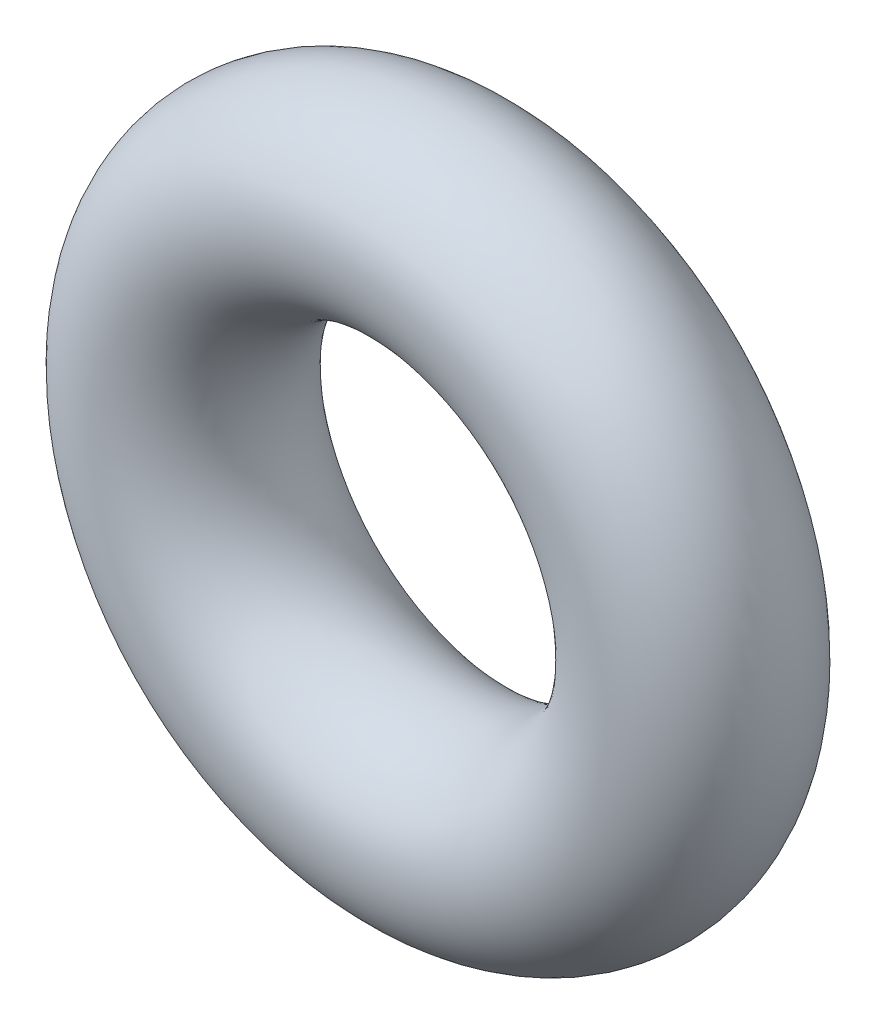
ISO-10303-21;
HEADER;
FILE_DESCRIPTION(('STEP AP214'),'2;1');
FILE_NAME('part.step','',(''),(''),'','','');
FILE_SCHEMA(('AUTOMOTIVE_DESIGN { 1 0 10303 214 1 1 1 1 }'));
ENDSEC;
DATA;
#1=APPLICATION_CONTEXT('core data for automotive mechanical design processes');
#2=APPLICATION_PROTOCOL_DEFINITION('international standard','automotive_design',2000,#1);
#3=PRODUCT_CONTEXT('',#1,'mechanical');
#4=PRODUCT('Part','Part','',(#3));
#5=PRODUCT_RELATED_PRODUCT_CATEGORY('part','',(#4));
#6=PRODUCT_DEFINITION_FORMATION('','',#4);
#7=PRODUCT_DEFINITION_CONTEXT('part definition',#1,'design');
#8=PRODUCT_DEFINITION('design','',#6,#7);
#9=PRODUCT_DEFINITION_SHAPE('','',#8);
#10=(LENGTH_UNIT() NAMED_UNIT(*) SI_UNIT(.MILLI.,.METRE.));
#11=(NAMED_UNIT(*) PLANE_ANGLE_UNIT() SI_UNIT($,.RADIAN.));
#12=(NAMED_UNIT(*) SI_UNIT($,.STERADIAN.) SOLID_ANGLE_UNIT());
#13=UNCERTAINTY_MEASURE_WITH_UNIT(LENGTH_MEASURE(1.E-05),#10,'distance_accuracy_value','');
#14=(GEOMETRIC_REPRESENTATION_CONTEXT(3) GLOBAL_UNCERTAINTY_ASSIGNED_CONTEXT((#13)) GLOBAL_UNIT_ASSIGNED_CONTEXT((#10,
#11,#12)) REPRESENTATION_CONTEXT('',''));
#15=CARTESIAN_POINT('',(0.,0.,0.));
#16=DIRECTION('',(0.,0.,1.));
#17=DIRECTION('',(1.,0.,0.));
#18=AXIS2_PLACEMENT_3D('',#15,#16,#17);
#19=CARTESIAN_POINT('',(0.,0.,0.));
#20=DIRECTION('',(0.,0.,1.));
#21=DIRECTION('',(1.,0.,0.));
#22=AXIS2_PLACEMENT_3D('',#19,#20,#21);
#23=TOROIDAL_SURFACE('',#22,2.3368,0.888999999999999);
#24=CARTESIAN_POINT('',(3.2258,0.,0.));
#25=VERTEX_POINT('',#24);
#26=VERTEX_LOOP('',#25);
#27=FACE_BOUND('',#26,.T.);
#28=ADVANCED_FACE('F32',(#27),#23,.T.);
#29=CLOSED_SHELL('',(#28));
#30=MANIFOLD_SOLID_BREP('B2',#29);
#31=ADVANCED_BREP_SHAPE_REPRESENTATION('',(#18,#30),#14);
#32=SHAPE_DEFINITION_REPRESENTATION(#9,#31);
ENDSEC;
END-ISO-10303-21;
